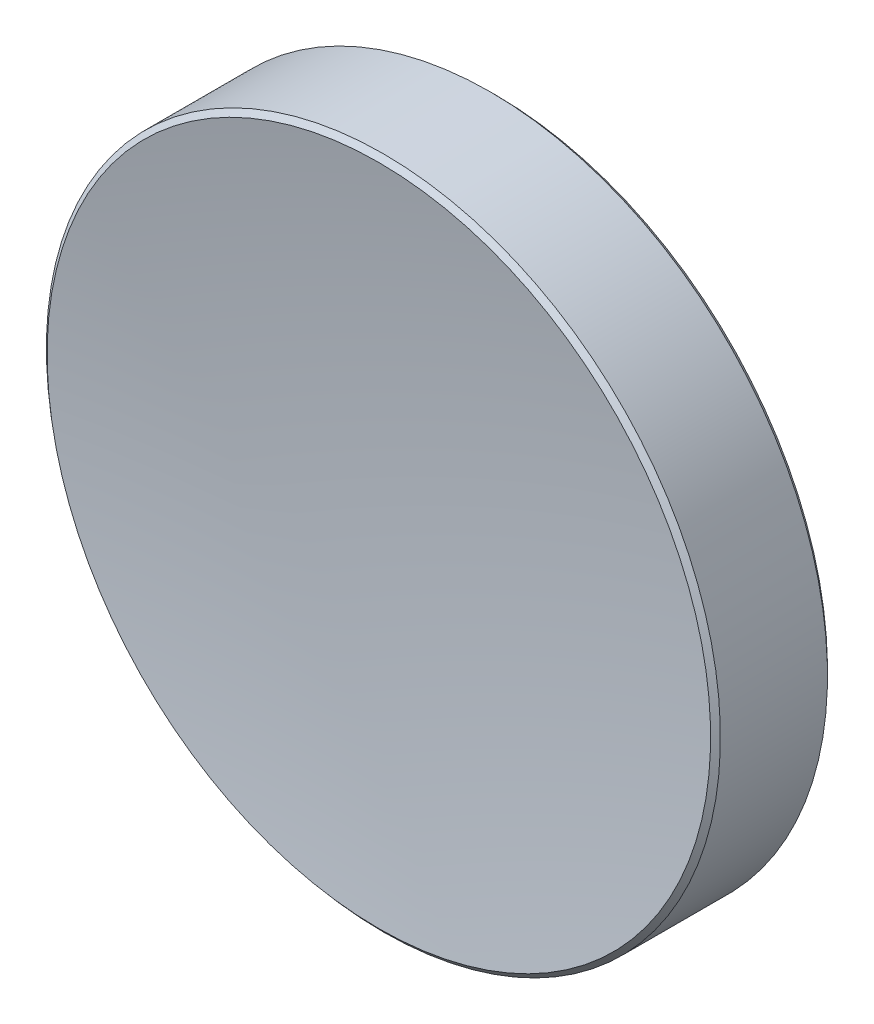
ISO-10303-21;
HEADER;
FILE_DESCRIPTION(('STEP AP214'),'2;1');
FILE_NAME('part.step','',(''),(''),'','','');
FILE_SCHEMA(('AUTOMOTIVE_DESIGN { 1 0 10303 214 1 1 1 1 }'));
ENDSEC;
DATA;
#1=APPLICATION_CONTEXT('core data for automotive mechanical design processes');
#2=APPLICATION_PROTOCOL_DEFINITION('international standard','automotive_design',2000,#1);
#3=PRODUCT_CONTEXT('',#1,'mechanical');
#4=PRODUCT('Part','Part','',(#3));
#5=PRODUCT_RELATED_PRODUCT_CATEGORY('part','',(#4));
#6=PRODUCT_DEFINITION_FORMATION('','',#4);
#7=PRODUCT_DEFINITION_CONTEXT('part definition',#1,'design');
#8=PRODUCT_DEFINITION('design','',#6,#7);
#9=PRODUCT_DEFINITION_SHAPE('','',#8);
#10=(LENGTH_UNIT() NAMED_UNIT(*) SI_UNIT(.MILLI.,.METRE.));
#11=(NAMED_UNIT(*) PLANE_ANGLE_UNIT() SI_UNIT($,.RADIAN.));
#12=(NAMED_UNIT(*) SI_UNIT($,.STERADIAN.) SOLID_ANGLE_UNIT());
#13=UNCERTAINTY_MEASURE_WITH_UNIT(LENGTH_MEASURE(1.E-05),#10,'distance_accuracy_value','');
#14=(GEOMETRIC_REPRESENTATION_CONTEXT(3) GLOBAL_UNCERTAINTY_ASSIGNED_CONTEXT((#13)) GLOBAL_UNIT_ASSIGNED_CONTEXT((#10,
#11,#12)) REPRESENTATION_CONTEXT('',''));
#15=CARTESIAN_POINT('',(0.,0.,0.));
#16=DIRECTION('',(0.,0.,1.));
#17=DIRECTION('',(1.,0.,0.));
#18=AXIS2_PLACEMENT_3D('',#15,#16,#17);
#19=CARTESIAN_POINT('',(0.,0.,-2.21722134126698));
#20=DIRECTION('',(0.,0.,-1.));
#21=DIRECTION('',(0.,1.,0.));
#22=AXIS2_PLACEMENT_3D('',#19,#20,#21);
#23=PLANE('',#22);
#24=CARTESIAN_POINT('',(0.,0.,-2.21722134126698));
#25=DIRECTION('',(0.,0.,-1.));
#26=DIRECTION('',(0.,1.,0.));
#27=AXIS2_PLACEMENT_3D('',#24,#25,#26);
#28=CIRCLE('',#27,12.5);
#29=CARTESIAN_POINT('',(0.,12.5,-2.21722134126698));
#30=VERTEX_POINT('',#29);
#31=EDGE_CURVE('E28',#30,#30,#28,.T.);
#32=ORIENTED_EDGE('',*,*,#31,.T.);
#33=EDGE_LOOP('',(#32));
#34=FACE_BOUND('',#33,.T.);
#35=ADVANCED_FACE('F13',(#34),#23,.T.);
#36=CARTESIAN_POINT('',(0.,0.,-2.21722134126698));
#37=DIRECTION('',(0.,0.,-1.));
#38=DIRECTION('',(0.,1.,0.));
#39=AXIS2_PLACEMENT_3D('',#36,#37,#38);
#40=CYLINDRICAL_SURFACE('',#39,12.7);
#41=CARTESIAN_POINT('',(0.,0.,-2.01722134126698));
#42=DIRECTION('',(0.,0.,-1.));
#43=DIRECTION('',(0.,1.,0.));
#44=AXIS2_PLACEMENT_3D('',#41,#42,#43);
#45=CIRCLE('',#44,12.7);
#46=CARTESIAN_POINT('',(0.,12.7,-2.01722134126698));
#47=VERTEX_POINT('',#46);
#48=EDGE_CURVE('E20',#47,#47,#45,.F.);
#49=ORIENTED_EDGE('',*,*,#48,.T.);
#50=EDGE_LOOP('',(#49));
#51=FACE_BOUND('',#50,.T.);
#52=CARTESIAN_POINT('',(0.,0.,2.01722134126697));
#53=DIRECTION('',(0.,0.,1.));
#54=DIRECTION('',(0.,-1.,0.));
#55=AXIS2_PLACEMENT_3D('',#52,#53,#54);
#56=CIRCLE('',#55,12.7);
#57=CARTESIAN_POINT('',(0.,-12.7,2.01722134126697));
#58=VERTEX_POINT('',#57);
#59=EDGE_CURVE('E24',#58,#58,#56,.F.);
#60=ORIENTED_EDGE('',*,*,#59,.T.);
#61=EDGE_LOOP('',(#60));
#62=FACE_BOUND('',#61,.T.);
#63=ADVANCED_FACE('F45',(#51,#62),#40,.T.);
#64=CARTESIAN_POINT('',(0.,0.,88.052778658733));
#65=DIRECTION('',(0.,0.,-1.));
#66=DIRECTION('',(0.,1.,0.));
#67=AXIS2_PLACEMENT_3D('',#64,#65,#66);
#68=SPHERICAL_SURFACE('',#67,86.77);
#69=CARTESIAN_POINT('',(0.,0.,2.18814784833128));
#70=DIRECTION('',(0.,0.,1.));
#71=DIRECTION('',(0.,-1.,0.));
#72=AXIS2_PLACEMENT_3D('',#69,#70,#71);
#73=CIRCLE('',#72,12.501922883837);
#74=CARTESIAN_POINT('',(0.,-12.501922883837,2.18814784833128));
#75=VERTEX_POINT('',#74);
#76=EDGE_CURVE('E9',#75,#75,#73,.T.);
#77=ORIENTED_EDGE('',*,*,#76,.T.);
#78=EDGE_LOOP('',(#77));
#79=FACE_BOUND('',#78,.T.);
#80=ADVANCED_FACE('F37',(#79),#68,.F.);
#81=CARTESIAN_POINT('',(0.,0.,-2.21722134126698));
#82=DIRECTION('',(0.,0.,1.));
#83=DIRECTION('',(0.,-1.,0.));
#84=AXIS2_PLACEMENT_3D('',#81,#82,#83);
#85=CONICAL_SURFACE('',#84,12.5,0.785398163397444);
#86=ORIENTED_EDGE('',*,*,#48,.F.);
#87=EDGE_LOOP('',(#86));
#88=FACE_BOUND('',#87,.T.);
#89=ORIENTED_EDGE('',*,*,#31,.F.);
#90=EDGE_LOOP('',(#89));
#91=FACE_BOUND('',#90,.T.);
#92=ADVANCED_FACE('F35',(#88,#91),#85,.T.);
#93=CARTESIAN_POINT('',(0.,0.,2.01722134126697));
#94=DIRECTION('',(0.,0.,-1.));
#95=DIRECTION('',(0.,1.,0.));
#96=AXIS2_PLACEMENT_3D('',#93,#94,#95);
#97=CONICAL_SURFACE('',#96,12.7,0.858843979175418);
#98=ORIENTED_EDGE('',*,*,#76,.F.);
#99=EDGE_LOOP('',(#98));
#100=FACE_BOUND('',#99,.T.);
#101=ORIENTED_EDGE('',*,*,#59,.F.);
#102=EDGE_LOOP('',(#101));
#103=FACE_BOUND('',#102,.T.);
#104=ADVANCED_FACE('F15',(#100,#103),#97,.T.);
#105=CLOSED_SHELL('',(#35,#63,#80,#92,#104));
#106=MANIFOLD_SOLID_BREP('B1',#105);
#107=ADVANCED_BREP_SHAPE_REPRESENTATION('',(#18,#106),#14);
#108=SHAPE_DEFINITION_REPRESENTATION(#9,#107);
ENDSEC;
END-ISO-10303-21;
